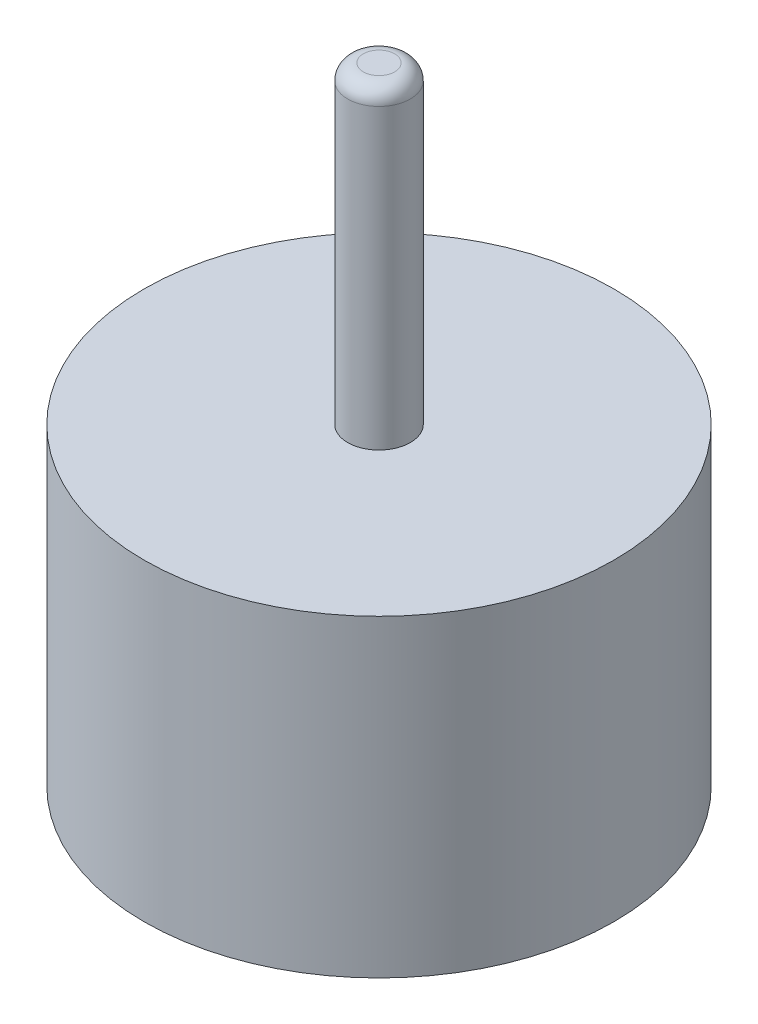
ISO-10303-21;
HEADER;
FILE_DESCRIPTION(('STEP AP214'),'2;1');
FILE_NAME('part.step','',(''),(''),'','','');
FILE_SCHEMA(('AUTOMOTIVE_DESIGN { 1 0 10303 214 1 1 1 1 }'));
ENDSEC;
DATA;
#1=APPLICATION_CONTEXT('core data for automotive mechanical design processes');
#2=APPLICATION_PROTOCOL_DEFINITION('international standard','automotive_design',2000,#1);
#3=PRODUCT_CONTEXT('',#1,'mechanical');
#4=PRODUCT('Part','Part','',(#3));
#5=PRODUCT_RELATED_PRODUCT_CATEGORY('part','',(#4));
#6=PRODUCT_DEFINITION_FORMATION('','',#4);
#7=PRODUCT_DEFINITION_CONTEXT('part definition',#1,'design');
#8=PRODUCT_DEFINITION('design','',#6,#7);
#9=PRODUCT_DEFINITION_SHAPE('','',#8);
#10=(LENGTH_UNIT() NAMED_UNIT(*) SI_UNIT(.MILLI.,.METRE.));
#11=(NAMED_UNIT(*) PLANE_ANGLE_UNIT() SI_UNIT($,.RADIAN.));
#12=(NAMED_UNIT(*) SI_UNIT($,.STERADIAN.) SOLID_ANGLE_UNIT());
#13=UNCERTAINTY_MEASURE_WITH_UNIT(LENGTH_MEASURE(1.E-05),#10,'distance_accuracy_value','');
#14=(GEOMETRIC_REPRESENTATION_CONTEXT(3) GLOBAL_UNCERTAINTY_ASSIGNED_CONTEXT((#13)) GLOBAL_UNIT_ASSIGNED_CONTEXT((#10,
#11,#12)) REPRESENTATION_CONTEXT('',''));
#15=CARTESIAN_POINT('',(0.,0.,0.));
#16=DIRECTION('',(0.,0.,1.));
#17=DIRECTION('',(1.,0.,0.));
#18=AXIS2_PLACEMENT_3D('',#15,#16,#17);
#19=CARTESIAN_POINT('',(0.,100.,0.));
#20=DIRECTION('',(0.,1.,0.));
#21=DIRECTION('',(0.,0.,1.));
#22=AXIS2_PLACEMENT_3D('',#19,#20,#21);
#23=PLANE('',#22);
#24=CARTESIAN_POINT('',(0.,100.,0.));
#25=DIRECTION('',(0.,1.,0.));
#26=DIRECTION('',(0.,0.,1.));
#27=AXIS2_PLACEMENT_3D('',#24,#25,#26);
#28=CIRCLE('',#27,75.);
#29=CARTESIAN_POINT('',(0.,100.,75.));
#30=VERTEX_POINT('',#29);
#31=EDGE_CURVE('E44',#30,#30,#28,.T.);
#32=ORIENTED_EDGE('',*,*,#31,.T.);
#33=EDGE_LOOP('',(#32));
#34=FACE_BOUND('',#33,.T.);
#35=CARTESIAN_POINT('',(0.,100.,0.));
#36=DIRECTION('',(0.,1.,0.));
#37=DIRECTION('',(0.,0.,1.));
#38=AXIS2_PLACEMENT_3D('',#35,#36,#37);
#39=CIRCLE('',#38,10.);
#40=CARTESIAN_POINT('',(0.,100.,10.));
#41=VERTEX_POINT('',#40);
#42=EDGE_CURVE('E52',#41,#41,#39,.T.);
#43=ORIENTED_EDGE('',*,*,#42,.F.);
#44=EDGE_LOOP('',(#43));
#45=FACE_BOUND('',#44,.T.);
#46=ADVANCED_FACE('F33',(#34,#45),#23,.T.);
#47=CARTESIAN_POINT('',(0.,100.,0.));
#48=DIRECTION('',(0.,-1.,0.));
#49=DIRECTION('',(0.,0.,-1.));
#50=AXIS2_PLACEMENT_3D('',#47,#48,#49);
#51=CYLINDRICAL_SURFACE('',#50,75.);
#52=ORIENTED_EDGE('',*,*,#31,.F.);
#53=EDGE_LOOP('',(#52));
#54=FACE_BOUND('',#53,.T.);
#55=CARTESIAN_POINT('',(0.,0.,0.));
#56=DIRECTION('',(0.,1.,0.));
#57=DIRECTION('',(0.,0.,1.));
#58=AXIS2_PLACEMENT_3D('',#55,#56,#57);
#59=CIRCLE('',#58,75.);
#60=CARTESIAN_POINT('',(0.,0.,75.));
#61=VERTEX_POINT('',#60);
#62=EDGE_CURVE('E48',#61,#61,#59,.T.);
#63=ORIENTED_EDGE('',*,*,#62,.T.);
#64=EDGE_LOOP('',(#63));
#65=FACE_BOUND('',#64,.T.);
#66=ADVANCED_FACE('F60',(#54,#65),#51,.T.);
#67=CARTESIAN_POINT('',(0.,0.,0.));
#68=DIRECTION('',(0.,1.,0.));
#69=DIRECTION('',(0.,0.,1.));
#70=AXIS2_PLACEMENT_3D('',#67,#68,#69);
#71=PLANE('',#70);
#72=ORIENTED_EDGE('',*,*,#62,.F.);
#73=EDGE_LOOP('',(#72));
#74=FACE_BOUND('',#73,.T.);
#75=ADVANCED_FACE('F66',(#74),#71,.F.);
#76=CARTESIAN_POINT('',(0.,200.,0.));
#77=DIRECTION('',(0.,-1.,0.));
#78=DIRECTION('',(0.,0.,-1.));
#79=AXIS2_PLACEMENT_3D('',#76,#77,#78);
#80=CYLINDRICAL_SURFACE('',#79,10.);
#81=CARTESIAN_POINT('',(0.,195.,0.));
#82=DIRECTION('',(0.,1.,0.));
#83=DIRECTION('',(0.,0.,1.));
#84=AXIS2_PLACEMENT_3D('',#81,#82,#83);
#85=CIRCLE('',#84,10.);
#86=CARTESIAN_POINT('',(0.,195.,10.));
#87=VERTEX_POINT('',#86);
#88=EDGE_CURVE('E10',#87,#87,#85,.F.);
#89=ORIENTED_EDGE('',*,*,#88,.T.);
#90=EDGE_LOOP('',(#89));
#91=FACE_BOUND('',#90,.T.);
#92=ORIENTED_EDGE('',*,*,#42,.T.);
#93=EDGE_LOOP('',(#92));
#94=FACE_BOUND('',#93,.T.);
#95=ADVANCED_FACE('F57',(#91,#94),#80,.T.);
#96=CARTESIAN_POINT('',(0.,200.,0.));
#97=DIRECTION('',(0.,1.,0.));
#98=DIRECTION('',(0.,0.,1.));
#99=AXIS2_PLACEMENT_3D('',#96,#97,#98);
#100=PLANE('',#99);
#101=CARTESIAN_POINT('',(0.,200.,0.));
#102=DIRECTION('',(0.,1.,0.));
#103=DIRECTION('',(0.,0.,1.));
#104=AXIS2_PLACEMENT_3D('',#101,#102,#103);
#105=CIRCLE('',#104,5.);
#106=CARTESIAN_POINT('',(0.,200.,5.));
#107=VERTEX_POINT('',#106);
#108=EDGE_CURVE('E40',#107,#107,#105,.T.);
#109=ORIENTED_EDGE('',*,*,#108,.T.);
#110=EDGE_LOOP('',(#109));
#111=FACE_BOUND('',#110,.T.);
#112=ADVANCED_FACE('F76',(#111),#100,.T.);
#113=CARTESIAN_POINT('',(0.,195.,0.));
#114=DIRECTION('',(0.,1.,0.));
#115=DIRECTION('',(0.,0.,1.));
#116=AXIS2_PLACEMENT_3D('',#113,#114,#115);
#117=DEGENERATE_TOROIDAL_SURFACE('',#116,5.,5.,.T.);
#118=ORIENTED_EDGE('',*,*,#88,.F.);
#119=EDGE_LOOP('',(#118));
#120=FACE_BOUND('',#119,.T.);
#121=ORIENTED_EDGE('',*,*,#108,.F.);
#122=EDGE_LOOP('',(#121));
#123=FACE_BOUND('',#122,.T.);
#124=ADVANCED_FACE('F35',(#120,#123),#117,.T.);
#125=CLOSED_SHELL('',(#46,#66,#75,#95,#112,#124));
#126=MANIFOLD_SOLID_BREP('B2',#125);
#127=ADVANCED_BREP_SHAPE_REPRESENTATION('',(#18,#126),#14);
#128=SHAPE_DEFINITION_REPRESENTATION(#9,#127);
ENDSEC;
END-ISO-10303-21;
